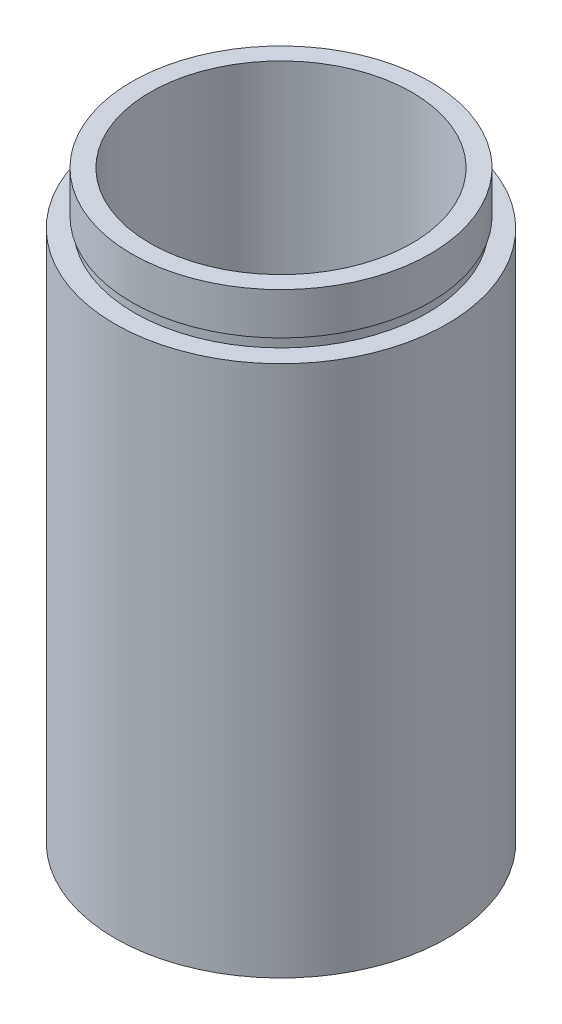
ISO-10303-21;
HEADER;
FILE_DESCRIPTION(('STEP AP214'),'2;1');
FILE_NAME('part.step','',(''),(''),'','','');
FILE_SCHEMA(('AUTOMOTIVE_DESIGN { 1 0 10303 214 1 1 1 1 }'));
ENDSEC;
DATA;
#1=APPLICATION_CONTEXT('core data for automotive mechanical design processes');
#2=APPLICATION_PROTOCOL_DEFINITION('international standard','automotive_design',2000,#1);
#3=PRODUCT_CONTEXT('',#1,'mechanical');
#4=PRODUCT('Part','Part','',(#3));
#5=PRODUCT_RELATED_PRODUCT_CATEGORY('part','',(#4));
#6=PRODUCT_DEFINITION_FORMATION('','',#4);
#7=PRODUCT_DEFINITION_CONTEXT('part definition',#1,'design');
#8=PRODUCT_DEFINITION('design','',#6,#7);
#9=PRODUCT_DEFINITION_SHAPE('','',#8);
#10=(LENGTH_UNIT() NAMED_UNIT(*) SI_UNIT(.MILLI.,.METRE.));
#11=(NAMED_UNIT(*) PLANE_ANGLE_UNIT() SI_UNIT($,.RADIAN.));
#12=(NAMED_UNIT(*) SI_UNIT($,.STERADIAN.) SOLID_ANGLE_UNIT());
#13=UNCERTAINTY_MEASURE_WITH_UNIT(LENGTH_MEASURE(1.E-05),#10,'distance_accuracy_value','');
#14=(GEOMETRIC_REPRESENTATION_CONTEXT(3) GLOBAL_UNCERTAINTY_ASSIGNED_CONTEXT((#13)) GLOBAL_UNIT_ASSIGNED_CONTEXT((#10,
#11,#12)) REPRESENTATION_CONTEXT('',''));
#15=CARTESIAN_POINT('',(0.,0.,0.));
#16=DIRECTION('',(0.,0.,1.));
#17=DIRECTION('',(1.,0.,0.));
#18=AXIS2_PLACEMENT_3D('',#15,#16,#17);
#19=CARTESIAN_POINT('',(14.25,0.,0.));
#20=DIRECTION('',(0.,1.,0.));
#21=DIRECTION('',(0.,0.,1.));
#22=AXIS2_PLACEMENT_3D('',#19,#20,#21);
#23=PLANE('',#22);
#24=CARTESIAN_POINT('',(0.,0.,0.));
#25=DIRECTION('',(0.,1.,0.));
#26=DIRECTION('',(0.,0.,1.));
#27=AXIS2_PLACEMENT_3D('',#24,#25,#26);
#28=CIRCLE('',#27,15.85);
#29=CARTESIAN_POINT('',(0.,0.,15.85));
#30=VERTEX_POINT('',#29);
#31=EDGE_CURVE('E10',#30,#30,#28,.T.);
#32=ORIENTED_EDGE('',*,*,#31,.F.);
#33=EDGE_LOOP('',(#32));
#34=FACE_BOUND('',#33,.T.);
#35=CARTESIAN_POINT('',(0.,0.,0.));
#36=DIRECTION('',(0.,1.,0.));
#37=DIRECTION('',(0.,0.,1.));
#38=AXIS2_PLACEMENT_3D('',#35,#36,#37);
#39=CIRCLE('',#38,14.25);
#40=CARTESIAN_POINT('',(0.,0.,14.25));
#41=VERTEX_POINT('',#40);
#42=EDGE_CURVE('E90',#41,#41,#39,.T.);
#43=ORIENTED_EDGE('',*,*,#42,.T.);
#44=EDGE_LOOP('',(#43));
#45=FACE_BOUND('',#44,.T.);
#46=ADVANCED_FACE('F39',(#34,#45),#23,.F.);
#47=CARTESIAN_POINT('',(0.,161.376166943427,0.));
#48=DIRECTION('',(0.,1.,0.));
#49=DIRECTION('',(0.,0.,1.));
#50=AXIS2_PLACEMENT_3D('',#47,#48,#49);
#51=CYLINDRICAL_SURFACE('',#50,15.85);
#52=CARTESIAN_POINT('',(0.,50.8,0.));
#53=DIRECTION('',(0.,1.,0.));
#54=DIRECTION('',(0.,0.,1.));
#55=AXIS2_PLACEMENT_3D('',#52,#53,#54);
#56=CIRCLE('',#55,15.85);
#57=CARTESIAN_POINT('',(0.,50.8,15.85));
#58=VERTEX_POINT('',#57);
#59=EDGE_CURVE('E46',#58,#58,#56,.T.);
#60=ORIENTED_EDGE('',*,*,#59,.F.);
#61=EDGE_LOOP('',(#60));
#62=FACE_BOUND('',#61,.T.);
#63=ORIENTED_EDGE('',*,*,#31,.T.);
#64=EDGE_LOOP('',(#63));
#65=FACE_BOUND('',#64,.T.);
#66=ADVANCED_FACE('F152',(#62,#65),#51,.T.);
#67=CARTESIAN_POINT('',(14.,50.8,0.));
#68=DIRECTION('',(0.,-1.,0.));
#69=DIRECTION('',(0.,0.,-1.));
#70=AXIS2_PLACEMENT_3D('',#67,#68,#69);
#71=PLANE('',#70);
#72=CARTESIAN_POINT('',(0.,50.8,0.));
#73=DIRECTION('',(0.,1.,0.));
#74=DIRECTION('',(0.,0.,1.));
#75=AXIS2_PLACEMENT_3D('',#72,#73,#74);
#76=CIRCLE('',#75,14.);
#77=CARTESIAN_POINT('',(0.,50.8,14.));
#78=VERTEX_POINT('',#77);
#79=EDGE_CURVE('E53',#78,#78,#76,.T.);
#80=ORIENTED_EDGE('',*,*,#79,.F.);
#81=EDGE_LOOP('',(#80));
#82=FACE_BOUND('',#81,.T.);
#83=ORIENTED_EDGE('',*,*,#59,.T.);
#84=EDGE_LOOP('',(#83));
#85=FACE_BOUND('',#84,.T.);
#86=ADVANCED_FACE('F147',(#82,#85),#71,.F.);
#87=CARTESIAN_POINT('',(0.,161.376166943427,0.));
#88=DIRECTION('',(0.,1.,0.));
#89=DIRECTION('',(0.,0.,1.));
#90=AXIS2_PLACEMENT_3D('',#87,#88,#89);
#91=CYLINDRICAL_SURFACE('',#90,14.);
#92=CARTESIAN_POINT('',(0.,51.8,0.));
#93=DIRECTION('',(0.,1.,0.));
#94=DIRECTION('',(0.,0.,1.));
#95=AXIS2_PLACEMENT_3D('',#92,#93,#94);
#96=CIRCLE('',#95,14.);
#97=CARTESIAN_POINT('',(0.,51.8,14.));
#98=VERTEX_POINT('',#97);
#99=EDGE_CURVE('E60',#98,#98,#96,.T.);
#100=ORIENTED_EDGE('',*,*,#99,.F.);
#101=EDGE_LOOP('',(#100));
#102=FACE_BOUND('',#101,.T.);
#103=ORIENTED_EDGE('',*,*,#79,.T.);
#104=EDGE_LOOP('',(#103));
#105=FACE_BOUND('',#104,.T.);
#106=ADVANCED_FACE('F141',(#102,#105),#91,.T.);
#107=CARTESIAN_POINT('',(14.,51.8,0.));
#108=DIRECTION('',(0.,1.,0.));
#109=DIRECTION('',(0.,0.,1.));
#110=AXIS2_PLACEMENT_3D('',#107,#108,#109);
#111=PLANE('',#110);
#112=CARTESIAN_POINT('',(0.,51.8,0.));
#113=DIRECTION('',(0.,1.,0.));
#114=DIRECTION('',(0.,0.,1.));
#115=AXIS2_PLACEMENT_3D('',#112,#113,#114);
#116=CIRCLE('',#115,14.25);
#117=CARTESIAN_POINT('',(0.,51.8,14.25));
#118=VERTEX_POINT('',#117);
#119=EDGE_CURVE('E66',#118,#118,#116,.T.);
#120=ORIENTED_EDGE('',*,*,#119,.F.);
#121=EDGE_LOOP('',(#120));
#122=FACE_BOUND('',#121,.T.);
#123=ORIENTED_EDGE('',*,*,#99,.T.);
#124=EDGE_LOOP('',(#123));
#125=FACE_BOUND('',#124,.T.);
#126=ADVANCED_FACE('F135',(#122,#125),#111,.F.);
#127=CARTESIAN_POINT('',(0.,161.376166943427,0.));
#128=DIRECTION('',(0.,1.,0.));
#129=DIRECTION('',(0.,0.,1.));
#130=AXIS2_PLACEMENT_3D('',#127,#128,#129);
#131=CYLINDRICAL_SURFACE('',#130,14.25);
#132=CARTESIAN_POINT('',(0.,55.8,0.));
#133=DIRECTION('',(0.,1.,0.));
#134=DIRECTION('',(0.,0.,1.));
#135=AXIS2_PLACEMENT_3D('',#132,#133,#134);
#136=CIRCLE('',#135,14.25);
#137=CARTESIAN_POINT('',(0.,55.8,14.25));
#138=VERTEX_POINT('',#137);
#139=EDGE_CURVE('E69',#138,#138,#136,.T.);
#140=ORIENTED_EDGE('',*,*,#139,.F.);
#141=EDGE_LOOP('',(#140));
#142=FACE_BOUND('',#141,.T.);
#143=ORIENTED_EDGE('',*,*,#119,.T.);
#144=EDGE_LOOP('',(#143));
#145=FACE_BOUND('',#144,.T.);
#146=ADVANCED_FACE('F129',(#142,#145),#131,.T.);
#147=CARTESIAN_POINT('',(12.5,55.8,0.));
#148=DIRECTION('',(0.,-1.,0.));
#149=DIRECTION('',(0.,0.,-1.));
#150=AXIS2_PLACEMENT_3D('',#147,#148,#149);
#151=PLANE('',#150);
#152=CARTESIAN_POINT('',(0.,55.8,0.));
#153=DIRECTION('',(0.,1.,0.));
#154=DIRECTION('',(0.,0.,1.));
#155=AXIS2_PLACEMENT_3D('',#152,#153,#154);
#156=CIRCLE('',#155,12.5);
#157=CARTESIAN_POINT('',(0.,55.8,12.5));
#158=VERTEX_POINT('',#157);
#159=EDGE_CURVE('E73',#158,#158,#156,.T.);
#160=ORIENTED_EDGE('',*,*,#159,.F.);
#161=EDGE_LOOP('',(#160));
#162=FACE_BOUND('',#161,.T.);
#163=ORIENTED_EDGE('',*,*,#139,.T.);
#164=EDGE_LOOP('',(#163));
#165=FACE_BOUND('',#164,.T.);
#166=ADVANCED_FACE('F123',(#162,#165),#151,.F.);
#167=CARTESIAN_POINT('',(0.,161.376166943427,0.));
#168=DIRECTION('',(0.,1.,0.));
#169=DIRECTION('',(0.,0.,1.));
#170=AXIS2_PLACEMENT_3D('',#167,#168,#169);
#171=CYLINDRICAL_SURFACE('',#170,12.5);
#172=CARTESIAN_POINT('',(0.,5.49999999999998,0.));
#173=DIRECTION('',(0.,1.,0.));
#174=DIRECTION('',(0.,0.,1.));
#175=AXIS2_PLACEMENT_3D('',#172,#173,#174);
#176=CIRCLE('',#175,12.5);
#177=CARTESIAN_POINT('',(0.,5.49999999999998,12.5));
#178=VERTEX_POINT('',#177);
#179=EDGE_CURVE('E76',#178,#178,#176,.T.);
#180=ORIENTED_EDGE('',*,*,#179,.F.);
#181=EDGE_LOOP('',(#180));
#182=FACE_BOUND('',#181,.T.);
#183=ORIENTED_EDGE('',*,*,#159,.T.);
#184=EDGE_LOOP('',(#183));
#185=FACE_BOUND('',#184,.T.);
#186=ADVANCED_FACE('F117',(#182,#185),#171,.F.);
#187=CARTESIAN_POINT('',(12.5,5.49999999999998,0.));
#188=DIRECTION('',(0.,1.,0.));
#189=DIRECTION('',(0.,0.,1.));
#190=AXIS2_PLACEMENT_3D('',#187,#188,#189);
#191=PLANE('',#190);
#192=CARTESIAN_POINT('',(0.,5.49999999999998,0.));
#193=DIRECTION('',(0.,1.,0.));
#194=DIRECTION('',(0.,0.,1.));
#195=AXIS2_PLACEMENT_3D('',#192,#193,#194);
#196=CIRCLE('',#195,14.35);
#197=CARTESIAN_POINT('',(0.,5.49999999999998,14.35));
#198=VERTEX_POINT('',#197);
#199=EDGE_CURVE('E79',#198,#198,#196,.T.);
#200=ORIENTED_EDGE('',*,*,#199,.F.);
#201=EDGE_LOOP('',(#200));
#202=FACE_BOUND('',#201,.T.);
#203=ORIENTED_EDGE('',*,*,#179,.T.);
#204=EDGE_LOOP('',(#203));
#205=FACE_BOUND('',#204,.T.);
#206=ADVANCED_FACE('F111',(#202,#205),#191,.F.);
#207=CARTESIAN_POINT('',(0.,161.376166943427,0.));
#208=DIRECTION('',(0.,1.,0.));
#209=DIRECTION('',(0.,0.,1.));
#210=AXIS2_PLACEMENT_3D('',#207,#208,#209);
#211=CYLINDRICAL_SURFACE('',#210,14.35);
#212=CARTESIAN_POINT('',(0.,4.49999999999998,0.));
#213=DIRECTION('',(0.,1.,0.));
#214=DIRECTION('',(0.,0.,1.));
#215=AXIS2_PLACEMENT_3D('',#212,#213,#214);
#216=CIRCLE('',#215,14.35);
#217=CARTESIAN_POINT('',(0.,4.49999999999998,14.35));
#218=VERTEX_POINT('',#217);
#219=EDGE_CURVE('E82',#218,#218,#216,.T.);
#220=ORIENTED_EDGE('',*,*,#219,.F.);
#221=EDGE_LOOP('',(#220));
#222=FACE_BOUND('',#221,.T.);
#223=ORIENTED_EDGE('',*,*,#199,.T.);
#224=EDGE_LOOP('',(#223));
#225=FACE_BOUND('',#224,.T.);
#226=ADVANCED_FACE('F105',(#222,#225),#211,.F.);
#227=CARTESIAN_POINT('',(14.25,4.50000000000001,0.));
#228=DIRECTION('',(0.,-1.,0.));
#229=DIRECTION('',(0.,0.,-1.));
#230=AXIS2_PLACEMENT_3D('',#227,#228,#229);
#231=PLANE('',#230);
#232=CARTESIAN_POINT('',(0.,4.50000000000003,0.));
#233=DIRECTION('',(0.,1.,0.));
#234=DIRECTION('',(0.,0.,1.));
#235=AXIS2_PLACEMENT_3D('',#232,#233,#234);
#236=CIRCLE('',#235,14.25);
#237=CARTESIAN_POINT('',(0.,4.50000000000003,14.25));
#238=VERTEX_POINT('',#237);
#239=EDGE_CURVE('E86',#238,#238,#236,.T.);
#240=ORIENTED_EDGE('',*,*,#239,.F.);
#241=EDGE_LOOP('',(#240));
#242=FACE_BOUND('',#241,.T.);
#243=ORIENTED_EDGE('',*,*,#219,.T.);
#244=EDGE_LOOP('',(#243));
#245=FACE_BOUND('',#244,.T.);
#246=ADVANCED_FACE('F99',(#242,#245),#231,.F.);
#247=CARTESIAN_POINT('',(0.,161.376166943427,0.));
#248=DIRECTION('',(0.,1.,0.));
#249=DIRECTION('',(0.,0.,1.));
#250=AXIS2_PLACEMENT_3D('',#247,#248,#249);
#251=CYLINDRICAL_SURFACE('',#250,14.25);
#252=ORIENTED_EDGE('',*,*,#42,.F.);
#253=EDGE_LOOP('',(#252));
#254=FACE_BOUND('',#253,.T.);
#255=ORIENTED_EDGE('',*,*,#239,.T.);
#256=EDGE_LOOP('',(#255));
#257=FACE_BOUND('',#256,.T.);
#258=ADVANCED_FACE('F96',(#254,#257),#251,.F.);
#259=CLOSED_SHELL('',(#46,#66,#86,#106,#126,#146,#166,#186,#206,#226,#246,#258));
#260=MANIFOLD_SOLID_BREP('B2',#259);
#261=ADVANCED_BREP_SHAPE_REPRESENTATION('',(#18,#260),#14);
#262=SHAPE_DEFINITION_REPRESENTATION(#9,#261);
ENDSEC;
END-ISO-10303-21;
